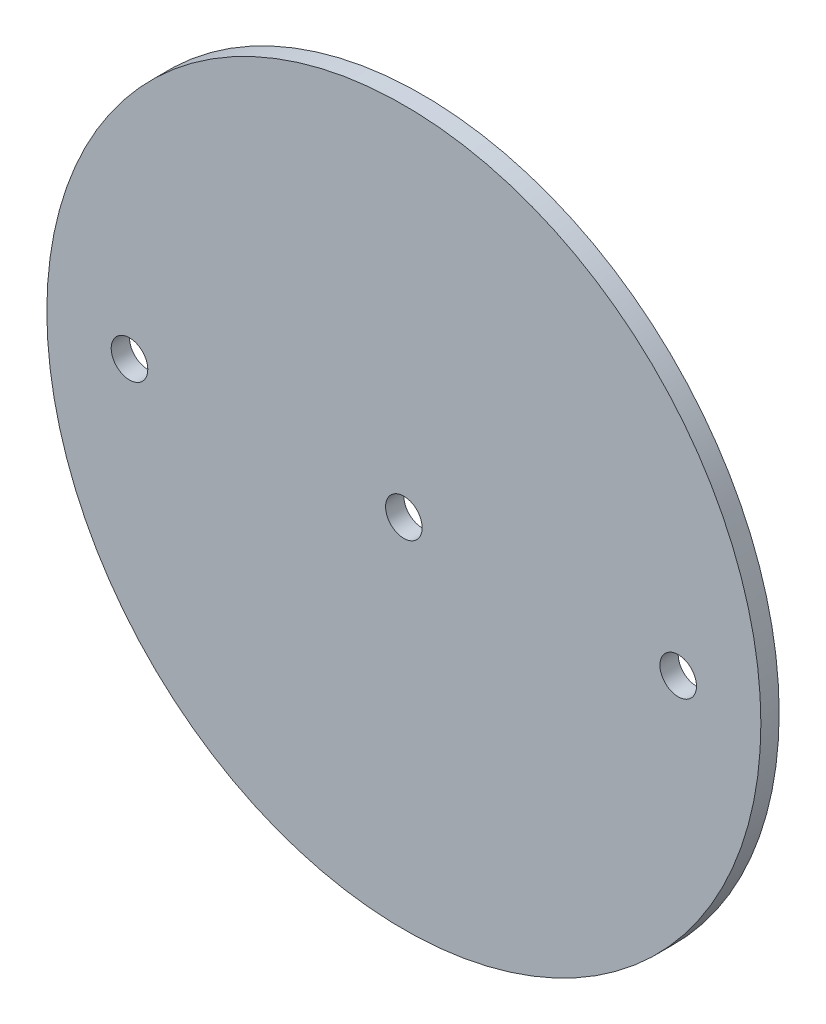
ISO-10303-21;
HEADER;
FILE_DESCRIPTION(('STEP AP214'),'2;1');
FILE_NAME('part.step','',(''),(''),'','','');
FILE_SCHEMA(('AUTOMOTIVE_DESIGN { 1 0 10303 214 1 1 1 1 }'));
ENDSEC;
DATA;
#1=APPLICATION_CONTEXT('core data for automotive mechanical design processes');
#2=APPLICATION_PROTOCOL_DEFINITION('international standard','automotive_design',2000,#1);
#3=PRODUCT_CONTEXT('',#1,'mechanical');
#4=PRODUCT('Part','Part','',(#3));
#5=PRODUCT_RELATED_PRODUCT_CATEGORY('part','',(#4));
#6=PRODUCT_DEFINITION_FORMATION('','',#4);
#7=PRODUCT_DEFINITION_CONTEXT('part definition',#1,'design');
#8=PRODUCT_DEFINITION('design','',#6,#7);
#9=PRODUCT_DEFINITION_SHAPE('','',#8);
#10=(LENGTH_UNIT() NAMED_UNIT(*) SI_UNIT(.MILLI.,.METRE.));
#11=(NAMED_UNIT(*) PLANE_ANGLE_UNIT() SI_UNIT($,.RADIAN.));
#12=(NAMED_UNIT(*) SI_UNIT($,.STERADIAN.) SOLID_ANGLE_UNIT());
#13=UNCERTAINTY_MEASURE_WITH_UNIT(LENGTH_MEASURE(1.E-05),#10,'distance_accuracy_value','');
#14=(GEOMETRIC_REPRESENTATION_CONTEXT(3) GLOBAL_UNCERTAINTY_ASSIGNED_CONTEXT((#13)) GLOBAL_UNIT_ASSIGNED_CONTEXT((#10,
#11,#12)) REPRESENTATION_CONTEXT('',''));
#15=CARTESIAN_POINT('',(0.,0.,0.));
#16=DIRECTION('',(0.,0.,1.));
#17=DIRECTION('',(1.,0.,0.));
#18=AXIS2_PLACEMENT_3D('',#15,#16,#17);
#19=CARTESIAN_POINT('',(0.,0.,1.5875));
#20=DIRECTION('',(0.,0.,-1.));
#21=DIRECTION('',(-1.,0.,0.));
#22=AXIS2_PLACEMENT_3D('',#19,#20,#21);
#23=CYLINDRICAL_SURFACE('',#22,61.976);
#24=CARTESIAN_POINT('',(0.,0.,1.5875));
#25=DIRECTION('',(0.,0.,1.));
#26=DIRECTION('',(1.,0.,0.));
#27=AXIS2_PLACEMENT_3D('',#24,#25,#26);
#28=CIRCLE('',#27,61.976);
#29=CARTESIAN_POINT('',(61.976,0.,1.5875));
#30=VERTEX_POINT('',#29);
#31=EDGE_CURVE('E10',#30,#30,#28,.T.);
#32=ORIENTED_EDGE('',*,*,#31,.F.);
#33=EDGE_LOOP('',(#32));
#34=FACE_BOUND('',#33,.T.);
#35=CARTESIAN_POINT('',(0.,0.,-1.5875));
#36=DIRECTION('',(0.,0.,1.));
#37=DIRECTION('',(1.,0.,0.));
#38=AXIS2_PLACEMENT_3D('',#35,#36,#37);
#39=CIRCLE('',#38,61.976);
#40=CARTESIAN_POINT('',(61.976,0.,-1.5875));
#41=VERTEX_POINT('',#40);
#42=EDGE_CURVE('E40',#41,#41,#39,.T.);
#43=ORIENTED_EDGE('',*,*,#42,.T.);
#44=EDGE_LOOP('',(#43));
#45=FACE_BOUND('',#44,.T.);
#46=ADVANCED_FACE('F37',(#34,#45),#23,.T.);
#47=CARTESIAN_POINT('',(0.,0.,1.5875));
#48=DIRECTION('',(0.,0.,1.));
#49=DIRECTION('',(1.,0.,0.));
#50=AXIS2_PLACEMENT_3D('',#47,#48,#49);
#51=PLANE('',#50);
#52=CARTESIAN_POINT('',(0.,0.,1.5875));
#53=DIRECTION('',(0.,0.,1.));
#54=DIRECTION('',(1.,0.,0.));
#55=AXIS2_PLACEMENT_3D('',#52,#53,#54);
#56=CIRCLE('',#55,3.17499999999999);
#57=CARTESIAN_POINT('',(3.17499999999999,0.,1.5875));
#58=VERTEX_POINT('',#57);
#59=EDGE_CURVE('E63',#58,#58,#56,.T.);
#60=ORIENTED_EDGE('',*,*,#59,.F.);
#61=EDGE_LOOP('',(#60));
#62=FACE_BOUND('',#61,.T.);
#63=CARTESIAN_POINT('',(47.625,0.,1.5875));
#64=DIRECTION('',(0.,0.,1.));
#65=DIRECTION('',(1.,0.,0.));
#66=AXIS2_PLACEMENT_3D('',#63,#64,#65);
#67=CIRCLE('',#66,3.17499999999998);
#68=CARTESIAN_POINT('',(50.8,0.,1.5875));
#69=VERTEX_POINT('',#68);
#70=EDGE_CURVE('E57',#69,#69,#67,.T.);
#71=ORIENTED_EDGE('',*,*,#70,.F.);
#72=EDGE_LOOP('',(#71));
#73=FACE_BOUND('',#72,.T.);
#74=CARTESIAN_POINT('',(-47.625,0.,1.5875));
#75=DIRECTION('',(0.,0.,1.));
#76=DIRECTION('',(1.,0.,0.));
#77=AXIS2_PLACEMENT_3D('',#74,#75,#76);
#78=CIRCLE('',#77,3.17499999999998);
#79=CARTESIAN_POINT('',(-44.45,0.,1.5875));
#80=VERTEX_POINT('',#79);
#81=EDGE_CURVE('E51',#80,#80,#78,.T.);
#82=ORIENTED_EDGE('',*,*,#81,.F.);
#83=EDGE_LOOP('',(#82));
#84=FACE_BOUND('',#83,.T.);
#85=ORIENTED_EDGE('',*,*,#31,.T.);
#86=EDGE_LOOP('',(#85));
#87=FACE_BOUND('',#86,.T.);
#88=ADVANCED_FACE('F69',(#62,#73,#84,#87),#51,.T.);
#89=CARTESIAN_POINT('',(0.,0.,-1.5875));
#90=DIRECTION('',(0.,0.,1.));
#91=DIRECTION('',(1.,0.,0.));
#92=AXIS2_PLACEMENT_3D('',#89,#90,#91);
#93=PLANE('',#92);
#94=CARTESIAN_POINT('',(0.,0.,-1.5875));
#95=DIRECTION('',(0.,0.,1.));
#96=DIRECTION('',(1.,0.,0.));
#97=AXIS2_PLACEMENT_3D('',#94,#95,#96);
#98=CIRCLE('',#97,3.17499999999999);
#99=CARTESIAN_POINT('',(3.17499999999999,0.,-1.5875));
#100=VERTEX_POINT('',#99);
#101=EDGE_CURVE('E60',#100,#100,#98,.T.);
#102=ORIENTED_EDGE('',*,*,#101,.T.);
#103=EDGE_LOOP('',(#102));
#104=FACE_BOUND('',#103,.T.);
#105=CARTESIAN_POINT('',(47.625,0.,-1.5875));
#106=DIRECTION('',(0.,0.,1.));
#107=DIRECTION('',(1.,0.,0.));
#108=AXIS2_PLACEMENT_3D('',#105,#106,#107);
#109=CIRCLE('',#108,3.17499999999999);
#110=CARTESIAN_POINT('',(50.8,0.,-1.5875));
#111=VERTEX_POINT('',#110);
#112=EDGE_CURVE('E54',#111,#111,#109,.T.);
#113=ORIENTED_EDGE('',*,*,#112,.T.);
#114=EDGE_LOOP('',(#113));
#115=FACE_BOUND('',#114,.T.);
#116=CARTESIAN_POINT('',(-47.625,0.,-1.5875));
#117=DIRECTION('',(0.,0.,1.));
#118=DIRECTION('',(1.,0.,0.));
#119=AXIS2_PLACEMENT_3D('',#116,#117,#118);
#120=CIRCLE('',#119,3.17499999999999);
#121=CARTESIAN_POINT('',(-44.45,0.,-1.5875));
#122=VERTEX_POINT('',#121);
#123=EDGE_CURVE('E47',#122,#122,#120,.T.);
#124=ORIENTED_EDGE('',*,*,#123,.T.);
#125=EDGE_LOOP('',(#124));
#126=FACE_BOUND('',#125,.T.);
#127=ORIENTED_EDGE('',*,*,#42,.F.);
#128=EDGE_LOOP('',(#127));
#129=FACE_BOUND('',#128,.T.);
#130=ADVANCED_FACE('F72',(#104,#115,#126,#129),#93,.F.);
#131=CARTESIAN_POINT('',(-47.625,0.,1.5875));
#132=DIRECTION('',(0.,0.,1.));
#133=DIRECTION('',(1.,0.,0.));
#134=AXIS2_PLACEMENT_3D('',#131,#132,#133);
#135=CYLINDRICAL_SURFACE('',#134,3.17499999999999);
#136=ORIENTED_EDGE('',*,*,#123,.F.);
#137=EDGE_LOOP('',(#136));
#138=FACE_BOUND('',#137,.T.);
#139=ORIENTED_EDGE('',*,*,#81,.T.);
#140=EDGE_LOOP('',(#139));
#141=FACE_BOUND('',#140,.T.);
#142=ADVANCED_FACE('F78',(#138,#141),#135,.F.);
#143=CARTESIAN_POINT('',(47.625,0.,1.5875));
#144=DIRECTION('',(0.,0.,1.));
#145=DIRECTION('',(1.,0.,0.));
#146=AXIS2_PLACEMENT_3D('',#143,#144,#145);
#147=CYLINDRICAL_SURFACE('',#146,3.17499999999999);
#148=ORIENTED_EDGE('',*,*,#112,.F.);
#149=EDGE_LOOP('',(#148));
#150=FACE_BOUND('',#149,.T.);
#151=ORIENTED_EDGE('',*,*,#70,.T.);
#152=EDGE_LOOP('',(#151));
#153=FACE_BOUND('',#152,.T.);
#154=ADVANCED_FACE('F80',(#150,#153),#147,.F.);
#155=CARTESIAN_POINT('',(0.,0.,1.5875));
#156=DIRECTION('',(0.,0.,1.));
#157=DIRECTION('',(1.,0.,0.));
#158=AXIS2_PLACEMENT_3D('',#155,#156,#157);
#159=CYLINDRICAL_SURFACE('',#158,3.17499999999999);
#160=ORIENTED_EDGE('',*,*,#101,.F.);
#161=EDGE_LOOP('',(#160));
#162=FACE_BOUND('',#161,.T.);
#163=ORIENTED_EDGE('',*,*,#59,.T.);
#164=EDGE_LOOP('',(#163));
#165=FACE_BOUND('',#164,.T.);
#166=ADVANCED_FACE('F67',(#162,#165),#159,.F.);
#167=CLOSED_SHELL('',(#46,#88,#130,#142,#154,#166));
#168=MANIFOLD_SOLID_BREP('B2',#167);
#169=ADVANCED_BREP_SHAPE_REPRESENTATION('',(#18,#168),#14);
#170=SHAPE_DEFINITION_REPRESENTATION(#9,#169);
ENDSEC;
END-ISO-10303-21;
